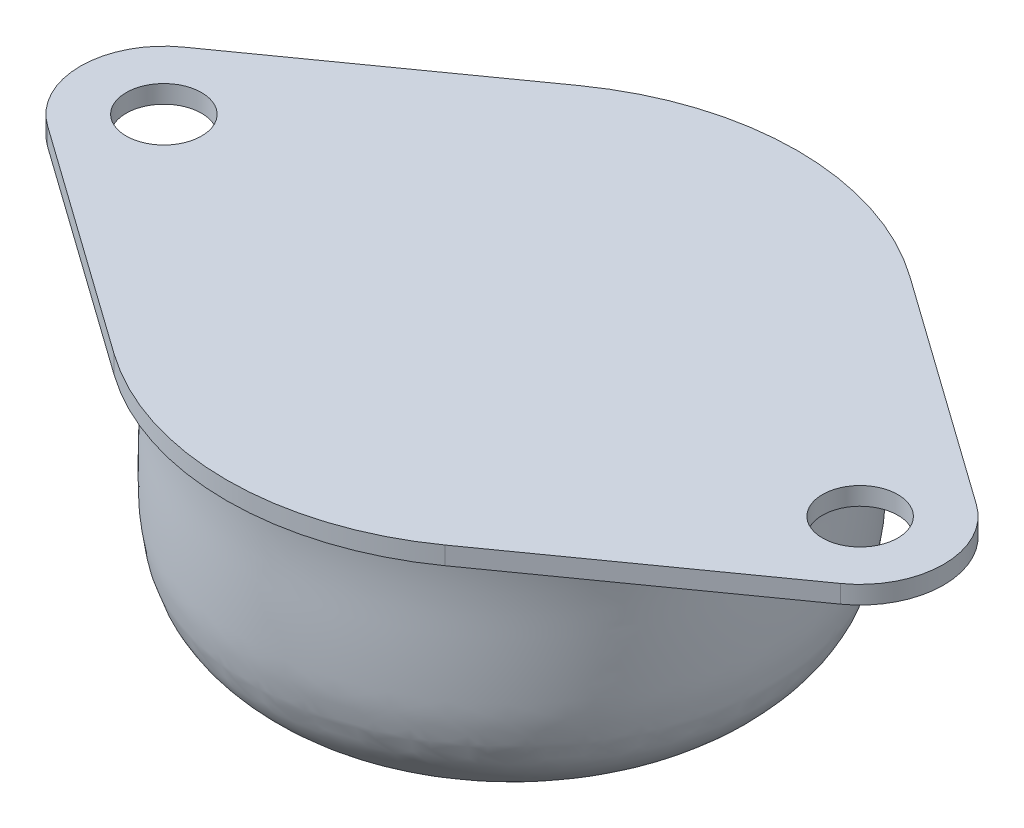
ISO-10303-21;
HEADER;
FILE_DESCRIPTION(('STEP AP214'),'2;1');
FILE_NAME('part.step','',(''),(''),'','','');
FILE_SCHEMA(('AUTOMOTIVE_DESIGN { 1 0 10303 214 1 1 1 1 }'));
ENDSEC;
DATA;
#1=APPLICATION_CONTEXT('core data for automotive mechanical design processes');
#2=APPLICATION_PROTOCOL_DEFINITION('international standard','automotive_design',2000,#1);
#3=PRODUCT_CONTEXT('',#1,'mechanical');
#4=PRODUCT('Part','Part','',(#3));
#5=PRODUCT_RELATED_PRODUCT_CATEGORY('part','',(#4));
#6=PRODUCT_DEFINITION_FORMATION('','',#4);
#7=PRODUCT_DEFINITION_CONTEXT('part definition',#1,'design');
#8=PRODUCT_DEFINITION('design','',#6,#7);
#9=PRODUCT_DEFINITION_SHAPE('','',#8);
#10=(LENGTH_UNIT() NAMED_UNIT(*) SI_UNIT(.MILLI.,.METRE.));
#11=(NAMED_UNIT(*) PLANE_ANGLE_UNIT() SI_UNIT($,.RADIAN.));
#12=(NAMED_UNIT(*) SI_UNIT($,.STERADIAN.) SOLID_ANGLE_UNIT());
#13=UNCERTAINTY_MEASURE_WITH_UNIT(LENGTH_MEASURE(1.E-05),#10,'distance_accuracy_value','');
#14=(GEOMETRIC_REPRESENTATION_CONTEXT(3) GLOBAL_UNCERTAINTY_ASSIGNED_CONTEXT((#13)) GLOBAL_UNIT_ASSIGNED_CONTEXT((#10,
#11,#12)) REPRESENTATION_CONTEXT('',''));
#15=CARTESIAN_POINT('',(0.,0.,0.));
#16=DIRECTION('',(0.,0.,1.));
#17=DIRECTION('',(1.,0.,0.));
#18=AXIS2_PLACEMENT_3D('',#15,#16,#17);
#19=CARTESIAN_POINT('',(0.,-3.29809436405037,0.));
#20=CARTESIAN_POINT('',(0.706455528044404,-3.33261629909782,0.));
#21=CARTESIAN_POINT('',(1.6910722755898,-3.21906486328135,0.));
#22=CARTESIAN_POINT('',(2.77317552219957,-2.87002827500623,0.));
#23=CARTESIAN_POINT('',(3.30502093185583,-2.66529212493262,0.));
#24=CARTESIAN_POINT('',(3.68241570619062,-2.51703889516262,0.));
#25=CARTESIAN_POINT('',(4.05064134544616,-2.35518976592076,0.));
#26=CARTESIAN_POINT('',(4.41669539876457,-2.20481684004063,0.));
#27=CARTESIAN_POINT('',(4.77817461951898,-2.00370671702629,0.));
#28=CARTESIAN_POINT('',(5.09992642423774,-1.75454297339482,0.));
#29=CARTESIAN_POINT('',(5.46924436614032,-1.550129904268,0.));
#30=CARTESIAN_POINT('',(5.86176845220872,-1.24506540903689,0.));
#31=CARTESIAN_POINT('',(6.26501645630921,-0.923290364909008,0.));
#32=CARTESIAN_POINT('',(6.63097437198885,-0.544071896653044,0.));
#33=CARTESIAN_POINT('',(6.92487506853863,-0.139959882478522,0.));
#34=CARTESIAN_POINT('',(7.37060468714255,0.0486860328995412,0.));
#35=CARTESIAN_POINT('',(7.77221826103112,0.161143877248647,0.));
#36=CARTESIAN_POINT('',(8.15898187630584,0.24790246973823,0.));
#37=CARTESIAN_POINT('',(8.57839920401572,0.358534367007594,0.));
#38=CARTESIAN_POINT('',(9.10951981998511,0.547037122191886,0.));
#39=CARTESIAN_POINT('',(9.69818302000994,0.720664570225371,0.));
#40=CARTESIAN_POINT('',(10.2597730853227,0.911045920080707,0.));
#41=CARTESIAN_POINT('',(10.7476107322952,1.02809482491382,0.));
#42=CARTESIAN_POINT('',(11.160281010587,1.21481497705429,0.));
#43=CARTESIAN_POINT('',(11.564815315527,1.48117860850391,0.));
#44=CARTESIAN_POINT('',(12.0001975589636,1.68041647211413,0.));
#45=CARTESIAN_POINT('',(12.456348877655,1.97889324984426,0.));
#46=CARTESIAN_POINT('',(12.8876719363935,2.33976498809418,0.));
#47=CARTESIAN_POINT('',(13.2914143685748,2.77038019782841,0.));
#48=CARTESIAN_POINT('',(13.6220583478846,3.17156146845381,0.));
#49=CARTESIAN_POINT('',(13.8754539399839,3.57421203179499,0.));
#50=CARTESIAN_POINT('',(14.1046298883454,3.98311962165361,0.));
#51=CARTESIAN_POINT('',(14.2480775200247,4.50808303010716,0.));
#52=CARTESIAN_POINT('',(14.4532558029486,4.97798444061005,0.));
#53=CARTESIAN_POINT('',(14.5532895102367,5.61354736358693,0.));
#54=CARTESIAN_POINT('',(14.6887977523506,6.35289882065059,0.));
#55=CARTESIAN_POINT('',(14.7445809334968,7.8503471982155,0.));
#56=CARTESIAN_POINT('',(14.7396624014368,9.91738679198446,0.));
#57=CARTESIAN_POINT('',(14.610748364971,12.7254174718238,0.));
#58=CARTESIAN_POINT('',(14.7455779461825,14.6550653663396,0.));
#59=CARTESIAN_POINT('',(14.9445851739056,15.7019056359496,0.));
#60=B_SPLINE_CURVE_WITH_KNOTS('',3,(#19,#20,#21,#22,#23,#24,#25,#26,#27,#28,#29,#30,#31,#32,#33,
#34,#35,#36,#37,#38,#39,#40,#41,#42,#43,#44,#45,#46,#47,#48,#49,#50,#51,#52,#53,#54,#55,#56,#57,
#58,#59),.UNSPECIFIED.,.F.,.F.,(4,1,1,1,1,1,1,1,1,1,1,1,1,1,1,1,1,1,1,1,1,1,1,1,1,1,1,1,1,1,1,1,
1,1,1,1,1,1,4),(0.,0.0749803268782476,0.104145363424742,0.120682551311053,0.135565386156596,
0.147239075819442,0.163438876454224,0.177614949493722,0.191043321568255,0.206610736255912,
0.222342480892859,0.2438225244745,0.261329251459024,0.278460385116613,0.295787666789211,
0.311179452900584,0.323053347641278,0.337863831243154,0.357273021709261,0.382918323063156,
0.40309839761296,0.420289185049471,0.436132055746469,0.450933536676359,0.471701704495396,
0.486863699890057,0.508750882665339,0.531302671258419,0.549552013705359,0.56388485327492,
0.581874699278751,0.599060538378736,0.621525795582886,0.636019374985955,0.667207467507946,
0.7014132534452,0.794955071123881,0.887064010438371,1.),.UNSPECIFIED.);
#61=CARTESIAN_POINT('',(0.,-3.29809436405037,0.));
#62=DIRECTION('',(0.,-1.,0.));
#63=AXIS1_PLACEMENT('',#61,#62);
#64=SURFACE_OF_REVOLUTION('',#60,#63);
#65=CARTESIAN_POINT('',(0.,-3.29809436405037,0.));
#66=VERTEX_POINT('',#65);
#67=VERTEX_LOOP('',#66);
#68=FACE_BOUND('',#67,.T.);
#69=CARTESIAN_POINT('',(0.,14.7019056359496,0.));
#70=DIRECTION('',(0.,-1.,0.));
#71=DIRECTION('',(0.,0.,-1.));
#72=AXIS2_PLACEMENT_3D('',#69,#70,#71);
#73=CIRCLE('',#72,14.7911016447568);
#74=CARTESIAN_POINT('',(0.,14.7019056359496,-14.7911016447568));
#75=VERTEX_POINT('',#74);
#76=EDGE_CURVE('E11',#75,#75,#73,.T.);
#77=ORIENTED_EDGE('',*,*,#76,.T.);
#78=EDGE_LOOP('',(#77));
#79=FACE_BOUND('',#78,.T.);
#80=ADVANCED_FACE('F41',(#68,#79),#64,.F.);
#81=CARTESIAN_POINT('',(0.,14.7019056359496,0.));
#82=DIRECTION('',(0.,1.,0.));
#83=DIRECTION('',(0.,0.,1.));
#84=AXIS2_PLACEMENT_3D('',#81,#82,#83);
#85=CYLINDRICAL_SURFACE('',#84,15.9);
#86=CARTESIAN_POINT('',(0.,15.7019056359496,0.));
#87=DIRECTION('',(0.,1.,0.));
#88=DIRECTION('',(0.,0.,1.));
#89=AXIS2_PLACEMENT_3D('',#86,#87,#88);
#90=CIRCLE('',#89,15.9);
#91=CARTESIAN_POINT('',(9.22036082474227,15.7019056359496,-12.9535688619607));
#92=VERTEX_POINT('',#91);
#93=CARTESIAN_POINT('',(-9.22036082474227,15.7019056359496,-12.9535688619607));
#94=VERTEX_POINT('',#93);
#95=EDGE_CURVE('E149',#92,#94,#90,.T.);
#96=ORIENTED_EDGE('',*,*,#95,.F.);
#97=DIRECTION('',(0.,1.,0.));
#98=VECTOR('',#97,1.);
#99=CARTESIAN_POINT('',(9.22036082474227,14.7019056359496,-12.9535688619607));
#100=LINE('',#99,#98);
#101=CARTESIAN_POINT('',(9.22036082474227,14.7019056359496,-12.9535688619607));
#102=VERTEX_POINT('',#101);
#103=EDGE_CURVE('E49',#102,#92,#100,.T.);
#104=ORIENTED_EDGE('',*,*,#103,.F.);
#105=CARTESIAN_POINT('',(0.,14.7019056359496,0.));
#106=DIRECTION('',(0.,1.,0.));
#107=DIRECTION('',(0.,0.,1.));
#108=AXIS2_PLACEMENT_3D('',#105,#106,#107);
#109=CIRCLE('',#108,15.9);
#110=CARTESIAN_POINT('',(-9.22036082474227,14.7019056359496,-12.9535688619607));
#111=VERTEX_POINT('',#110);
#112=EDGE_CURVE('E179',#102,#111,#109,.T.);
#113=ORIENTED_EDGE('',*,*,#112,.T.);
#114=DIRECTION('',(0.,1.,0.));
#115=VECTOR('',#114,1.);
#116=CARTESIAN_POINT('',(-9.22036082474227,14.7019056359496,-12.9535688619607));
#117=LINE('',#116,#115);
#118=EDGE_CURVE('E97',#111,#94,#117,.T.);
#119=ORIENTED_EDGE('',*,*,#118,.T.);
#120=EDGE_LOOP('',(#96,#104,#113,#119));
#121=FACE_BOUND('',#120,.T.);
#122=ADVANCED_FACE('F202',(#121),#85,.T.);
#123=CARTESIAN_POINT('',(9.22036082474227,14.7019056359496,-12.9535688619607));
#124=DIRECTION('',(0.579896907216495,0.,-0.81468986553212));
#125=DIRECTION('',(-0.81468986553212,0.,-0.579896907216495));
#126=AXIS2_PLACEMENT_3D('',#123,#124,#125);
#127=PLANE('',#126);
#128=DIRECTION('',(-0.81468986553212,0.,-0.579896907216495));
#129=VECTOR('',#128,1.);
#130=CARTESIAN_POINT('',(9.22036082474227,15.7019056359496,-12.9535688619607));
#131=LINE('',#130,#129);
#132=CARTESIAN_POINT('',(22.0965206185567,15.7019056359496,-3.78830787472436));
#133=VERTEX_POINT('',#132);
#134=EDGE_CURVE('E175',#133,#92,#131,.T.);
#135=ORIENTED_EDGE('',*,*,#134,.F.);
#136=DIRECTION('',(0.,1.,0.));
#137=VECTOR('',#136,1.);
#138=CARTESIAN_POINT('',(22.0965206185567,14.7019056359496,-3.78830787472436));
#139=LINE('',#138,#137);
#140=CARTESIAN_POINT('',(22.0965206185567,14.7019056359496,-3.78830787472436));
#141=VERTEX_POINT('',#140);
#142=EDGE_CURVE('E126',#141,#133,#139,.T.);
#143=ORIENTED_EDGE('',*,*,#142,.F.);
#144=DIRECTION('',(-0.81468986553212,0.,-0.579896907216495));
#145=VECTOR('',#144,1.);
#146=CARTESIAN_POINT('',(9.22036082474227,14.7019056359496,-12.9535688619607));
#147=LINE('',#146,#145);
#148=EDGE_CURVE('E135',#141,#102,#147,.T.);
#149=ORIENTED_EDGE('',*,*,#148,.T.);
#150=ORIENTED_EDGE('',*,*,#103,.T.);
#151=EDGE_LOOP('',(#135,#143,#149,#150));
#152=FACE_BOUND('',#151,.T.);
#153=ADVANCED_FACE('F207',(#152),#127,.T.);
#154=CARTESIAN_POINT('',(19.4,14.7019056359496,0.));
#155=DIRECTION('',(0.,1.,0.));
#156=DIRECTION('',(0.,0.,1.));
#157=AXIS2_PLACEMENT_3D('',#154,#155,#156);
#158=CYLINDRICAL_SURFACE('',#157,4.65);
#159=CARTESIAN_POINT('',(19.4,15.7019056359496,0.));
#160=DIRECTION('',(0.,1.,0.));
#161=DIRECTION('',(0.,0.,1.));
#162=AXIS2_PLACEMENT_3D('',#159,#160,#161);
#163=CIRCLE('',#162,4.65);
#164=CARTESIAN_POINT('',(22.0965206185567,15.7019056359496,3.78830787472436));
#165=VERTEX_POINT('',#164);
#166=EDGE_CURVE('E120',#165,#133,#163,.T.);
#167=ORIENTED_EDGE('',*,*,#166,.F.);
#168=DIRECTION('',(0.,1.,0.));
#169=VECTOR('',#168,1.);
#170=CARTESIAN_POINT('',(22.0965206185567,14.7019056359496,3.78830787472436));
#171=LINE('',#170,#169);
#172=CARTESIAN_POINT('',(22.0965206185567,14.7019056359496,3.78830787472436));
#173=VERTEX_POINT('',#172);
#174=EDGE_CURVE('E114',#173,#165,#171,.T.);
#175=ORIENTED_EDGE('',*,*,#174,.F.);
#176=CARTESIAN_POINT('',(19.4,14.7019056359496,0.));
#177=DIRECTION('',(0.,1.,0.));
#178=DIRECTION('',(0.,0.,1.));
#179=AXIS2_PLACEMENT_3D('',#176,#177,#178);
#180=CIRCLE('',#179,4.65);
#181=EDGE_CURVE('E117',#173,#141,#180,.T.);
#182=ORIENTED_EDGE('',*,*,#181,.T.);
#183=ORIENTED_EDGE('',*,*,#142,.T.);
#184=EDGE_LOOP('',(#167,#175,#182,#183));
#185=FACE_BOUND('',#184,.T.);
#186=ADVANCED_FACE('F116',(#185),#158,.T.);
#187=CARTESIAN_POINT('',(22.0965206185567,14.7019056359496,3.78830787472436));
#188=DIRECTION('',(0.579896907216495,0.,0.81468986553212));
#189=DIRECTION('',(0.81468986553212,0.,-0.579896907216495));
#190=AXIS2_PLACEMENT_3D('',#187,#188,#189);
#191=PLANE('',#190);
#192=DIRECTION('',(0.81468986553212,0.,-0.579896907216495));
#193=VECTOR('',#192,1.);
#194=CARTESIAN_POINT('',(22.0965206185567,15.7019056359496,3.78830787472436));
#195=LINE('',#194,#193);
#196=CARTESIAN_POINT('',(9.22036082474227,15.7019056359496,12.9535688619607));
#197=VERTEX_POINT('',#196);
#198=EDGE_CURVE('E170',#197,#165,#195,.T.);
#199=ORIENTED_EDGE('',*,*,#198,.F.);
#200=DIRECTION('',(0.,1.,0.));
#201=VECTOR('',#200,1.);
#202=CARTESIAN_POINT('',(9.22036082474227,14.7019056359496,12.9535688619607));
#203=LINE('',#202,#201);
#204=CARTESIAN_POINT('',(9.22036082474227,14.7019056359496,12.9535688619607));
#205=VERTEX_POINT('',#204);
#206=EDGE_CURVE('E127',#205,#197,#203,.T.);
#207=ORIENTED_EDGE('',*,*,#206,.F.);
#208=DIRECTION('',(0.81468986553212,0.,-0.579896907216495));
#209=VECTOR('',#208,1.);
#210=CARTESIAN_POINT('',(22.0965206185567,14.7019056359496,3.78830787472436));
#211=LINE('',#210,#209);
#212=EDGE_CURVE('E133',#205,#173,#211,.T.);
#213=ORIENTED_EDGE('',*,*,#212,.T.);
#214=ORIENTED_EDGE('',*,*,#174,.T.);
#215=EDGE_LOOP('',(#199,#207,#213,#214));
#216=FACE_BOUND('',#215,.T.);
#217=ADVANCED_FACE('F138',(#216),#191,.T.);
#218=CARTESIAN_POINT('',(0.,14.7019056359496,0.));
#219=DIRECTION('',(0.,1.,0.));
#220=DIRECTION('',(0.,0.,1.));
#221=AXIS2_PLACEMENT_3D('',#218,#219,#220);
#222=CYLINDRICAL_SURFACE('',#221,15.9);
#223=CARTESIAN_POINT('',(0.,15.7019056359496,0.));
#224=DIRECTION('',(0.,1.,0.));
#225=DIRECTION('',(0.,0.,1.));
#226=AXIS2_PLACEMENT_3D('',#223,#224,#225);
#227=CIRCLE('',#226,15.9);
#228=CARTESIAN_POINT('',(-9.22036082474227,15.7019056359496,12.9535688619607));
#229=VERTEX_POINT('',#228);
#230=EDGE_CURVE('E166',#229,#197,#227,.T.);
#231=ORIENTED_EDGE('',*,*,#230,.F.);
#232=DIRECTION('',(0.,1.,0.));
#233=VECTOR('',#232,1.);
#234=CARTESIAN_POINT('',(-9.22036082474227,14.7019056359496,12.9535688619607));
#235=LINE('',#234,#233);
#236=CARTESIAN_POINT('',(-9.22036082474227,14.7019056359496,12.9535688619607));
#237=VERTEX_POINT('',#236);
#238=EDGE_CURVE('E186',#237,#229,#235,.T.);
#239=ORIENTED_EDGE('',*,*,#238,.F.);
#240=CARTESIAN_POINT('',(0.,14.7019056359496,0.));
#241=DIRECTION('',(0.,1.,0.));
#242=DIRECTION('',(0.,0.,1.));
#243=AXIS2_PLACEMENT_3D('',#240,#241,#242);
#244=CIRCLE('',#243,15.9);
#245=EDGE_CURVE('E140',#237,#205,#244,.T.);
#246=ORIENTED_EDGE('',*,*,#245,.T.);
#247=ORIENTED_EDGE('',*,*,#206,.T.);
#248=EDGE_LOOP('',(#231,#239,#246,#247));
#249=FACE_BOUND('',#248,.T.);
#250=ADVANCED_FACE('F262',(#249),#222,.T.);
#251=CARTESIAN_POINT('',(-22.0965206185567,14.7019056359496,3.78830787472436));
#252=DIRECTION('',(-0.579896907216495,0.,0.81468986553212));
#253=DIRECTION('',(0.81468986553212,0.,0.579896907216495));
#254=AXIS2_PLACEMENT_3D('',#251,#252,#253);
#255=PLANE('',#254);
#256=DIRECTION('',(0.81468986553212,0.,0.579896907216495));
#257=VECTOR('',#256,1.);
#258=CARTESIAN_POINT('',(-22.0965206185567,15.7019056359496,3.78830787472436));
#259=LINE('',#258,#257);
#260=CARTESIAN_POINT('',(-22.0965206185567,15.7019056359496,3.78830787472436));
#261=VERTEX_POINT('',#260);
#262=EDGE_CURVE('E162',#261,#229,#259,.T.);
#263=ORIENTED_EDGE('',*,*,#262,.F.);
#264=DIRECTION('',(0.,1.,0.));
#265=VECTOR('',#264,1.);
#266=CARTESIAN_POINT('',(-22.0965206185567,14.7019056359496,3.78830787472436));
#267=LINE('',#266,#265);
#268=CARTESIAN_POINT('',(-22.0965206185567,14.7019056359496,3.78830787472436));
#269=VERTEX_POINT('',#268);
#270=EDGE_CURVE('E189',#269,#261,#267,.T.);
#271=ORIENTED_EDGE('',*,*,#270,.F.);
#272=DIRECTION('',(0.81468986553212,0.,0.579896907216495));
#273=VECTOR('',#272,1.);
#274=CARTESIAN_POINT('',(-22.0965206185567,14.7019056359496,3.78830787472436));
#275=LINE('',#274,#273);
#276=EDGE_CURVE('E143',#269,#237,#275,.T.);
#277=ORIENTED_EDGE('',*,*,#276,.T.);
#278=ORIENTED_EDGE('',*,*,#238,.T.);
#279=EDGE_LOOP('',(#263,#271,#277,#278));
#280=FACE_BOUND('',#279,.T.);
#281=ADVANCED_FACE('F256',(#280),#255,.T.);
#282=CARTESIAN_POINT('',(-19.4,14.7019056359496,0.));
#283=DIRECTION('',(0.,1.,0.));
#284=DIRECTION('',(0.,0.,1.));
#285=AXIS2_PLACEMENT_3D('',#282,#283,#284);
#286=CYLINDRICAL_SURFACE('',#285,4.65);
#287=CARTESIAN_POINT('',(-19.4,15.7019056359496,0.));
#288=DIRECTION('',(0.,1.,0.));
#289=DIRECTION('',(0.,0.,-1.));
#290=AXIS2_PLACEMENT_3D('',#287,#288,#289);
#291=CIRCLE('',#290,4.65);
#292=CARTESIAN_POINT('',(-22.0965206185567,15.7019056359496,-3.78830787472436));
#293=VERTEX_POINT('',#292);
#294=EDGE_CURVE('E158',#293,#261,#291,.T.);
#295=ORIENTED_EDGE('',*,*,#294,.F.);
#296=DIRECTION('',(0.,1.,0.));
#297=VECTOR('',#296,1.);
#298=CARTESIAN_POINT('',(-22.0965206185567,14.7019056359496,-3.78830787472436));
#299=LINE('',#298,#297);
#300=CARTESIAN_POINT('',(-22.0965206185567,14.7019056359496,-3.78830787472436));
#301=VERTEX_POINT('',#300);
#302=EDGE_CURVE('E192',#301,#293,#299,.T.);
#303=ORIENTED_EDGE('',*,*,#302,.F.);
#304=CARTESIAN_POINT('',(-19.4,14.7019056359496,0.));
#305=DIRECTION('',(0.,1.,0.));
#306=DIRECTION('',(0.,0.,-1.));
#307=AXIS2_PLACEMENT_3D('',#304,#305,#306);
#308=CIRCLE('',#307,4.65);
#309=EDGE_CURVE('E248',#301,#269,#308,.T.);
#310=ORIENTED_EDGE('',*,*,#309,.T.);
#311=ORIENTED_EDGE('',*,*,#270,.T.);
#312=EDGE_LOOP('',(#295,#303,#310,#311));
#313=FACE_BOUND('',#312,.T.);
#314=ADVANCED_FACE('F260',(#313),#286,.T.);
#315=CARTESIAN_POINT('',(-9.22036082474227,14.7019056359496,-12.9535688619607));
#316=DIRECTION('',(-0.579896907216495,0.,-0.81468986553212));
#317=DIRECTION('',(-0.81468986553212,0.,0.579896907216495));
#318=AXIS2_PLACEMENT_3D('',#315,#316,#317);
#319=PLANE('',#318);
#320=DIRECTION('',(-0.81468986553212,0.,0.579896907216495));
#321=VECTOR('',#320,1.);
#322=CARTESIAN_POINT('',(-9.22036082474227,15.7019056359496,-12.9535688619607));
#323=LINE('',#322,#321);
#324=EDGE_CURVE('E153',#94,#293,#323,.T.);
#325=ORIENTED_EDGE('',*,*,#324,.F.);
#326=ORIENTED_EDGE('',*,*,#118,.F.);
#327=DIRECTION('',(-0.81468986553212,0.,0.579896907216495));
#328=VECTOR('',#327,1.);
#329=CARTESIAN_POINT('',(-9.22036082474227,14.7019056359496,-12.9535688619607));
#330=LINE('',#329,#328);
#331=EDGE_CURVE('E245',#111,#301,#330,.T.);
#332=ORIENTED_EDGE('',*,*,#331,.T.);
#333=ORIENTED_EDGE('',*,*,#302,.T.);
#334=EDGE_LOOP('',(#325,#326,#332,#333));
#335=FACE_BOUND('',#334,.T.);
#336=ADVANCED_FACE('F203',(#335),#319,.T.);
#337=CARTESIAN_POINT('',(0.,14.7019056359496,0.));
#338=DIRECTION('',(0.,1.,0.));
#339=DIRECTION('',(0.,0.,1.));
#340=AXIS2_PLACEMENT_3D('',#337,#338,#339);
#341=PLANE('',#340);
#342=ORIENTED_EDGE('',*,*,#76,.F.);
#343=EDGE_LOOP('',(#342));
#344=FACE_BOUND('',#343,.T.);
#345=CARTESIAN_POINT('',(-19.4,14.7019056359496,0.));
#346=DIRECTION('',(0.,1.,0.));
#347=DIRECTION('',(0.,0.,-1.));
#348=AXIS2_PLACEMENT_3D('',#345,#346,#347);
#349=CIRCLE('',#348,2.1);
#350=CARTESIAN_POINT('',(-19.4,14.7019056359496,-2.1));
#351=VERTEX_POINT('',#350);
#352=EDGE_CURVE('E229',#351,#351,#349,.T.);
#353=ORIENTED_EDGE('',*,*,#352,.T.);
#354=EDGE_LOOP('',(#353));
#355=FACE_BOUND('',#354,.T.);
#356=CARTESIAN_POINT('',(19.4,14.7019056359496,0.));
#357=DIRECTION('',(0.,1.,0.));
#358=DIRECTION('',(0.,0.,1.));
#359=AXIS2_PLACEMENT_3D('',#356,#357,#358);
#360=CIRCLE('',#359,2.1);
#361=CARTESIAN_POINT('',(19.4,14.7019056359496,2.1));
#362=VERTEX_POINT('',#361);
#363=EDGE_CURVE('E154',#362,#362,#360,.T.);
#364=ORIENTED_EDGE('',*,*,#363,.T.);
#365=EDGE_LOOP('',(#364));
#366=FACE_BOUND('',#365,.T.);
#367=ORIENTED_EDGE('',*,*,#112,.F.);
#368=ORIENTED_EDGE('',*,*,#148,.F.);
#369=ORIENTED_EDGE('',*,*,#181,.F.);
#370=ORIENTED_EDGE('',*,*,#212,.F.);
#371=ORIENTED_EDGE('',*,*,#245,.F.);
#372=ORIENTED_EDGE('',*,*,#276,.F.);
#373=ORIENTED_EDGE('',*,*,#309,.F.);
#374=ORIENTED_EDGE('',*,*,#331,.F.);
#375=EDGE_LOOP('',(#367,#368,#369,#370,#371,#372,#373,#374));
#376=FACE_BOUND('',#375,.T.);
#377=ADVANCED_FACE('F131',(#344,#355,#366,#376),#341,.F.);
#378=CARTESIAN_POINT('',(19.4,14.7019056359496,0.));
#379=DIRECTION('',(0.,1.,0.));
#380=DIRECTION('',(0.,0.,1.));
#381=AXIS2_PLACEMENT_3D('',#378,#379,#380);
#382=CYLINDRICAL_SURFACE('',#381,2.1);
#383=ORIENTED_EDGE('',*,*,#363,.F.);
#384=EDGE_LOOP('',(#383));
#385=FACE_BOUND('',#384,.T.);
#386=CARTESIAN_POINT('',(19.4,15.7019056359496,0.));
#387=DIRECTION('',(0.,1.,0.));
#388=DIRECTION('',(0.,0.,1.));
#389=AXIS2_PLACEMENT_3D('',#386,#387,#388);
#390=CIRCLE('',#389,2.1);
#391=CARTESIAN_POINT('',(19.4,15.7019056359496,2.1));
#392=VERTEX_POINT('',#391);
#393=EDGE_CURVE('E234',#392,#392,#390,.T.);
#394=ORIENTED_EDGE('',*,*,#393,.T.);
#395=EDGE_LOOP('',(#394));
#396=FACE_BOUND('',#395,.T.);
#397=ADVANCED_FACE('F225',(#385,#396),#382,.F.);
#398=CARTESIAN_POINT('',(-19.4,14.7019056359496,0.));
#399=DIRECTION('',(0.,1.,0.));
#400=DIRECTION('',(0.,0.,1.));
#401=AXIS2_PLACEMENT_3D('',#398,#399,#400);
#402=CYLINDRICAL_SURFACE('',#401,2.1);
#403=ORIENTED_EDGE('',*,*,#352,.F.);
#404=EDGE_LOOP('',(#403));
#405=FACE_BOUND('',#404,.T.);
#406=CARTESIAN_POINT('',(-19.4,15.7019056359496,0.));
#407=DIRECTION('',(0.,1.,0.));
#408=DIRECTION('',(0.,0.,-1.));
#409=AXIS2_PLACEMENT_3D('',#406,#407,#408);
#410=CIRCLE('',#409,2.1);
#411=CARTESIAN_POINT('',(-19.4,15.7019056359496,-2.1));
#412=VERTEX_POINT('',#411);
#413=EDGE_CURVE('E240',#412,#412,#410,.T.);
#414=ORIENTED_EDGE('',*,*,#413,.T.);
#415=EDGE_LOOP('',(#414));
#416=FACE_BOUND('',#415,.T.);
#417=ADVANCED_FACE('F276',(#405,#416),#402,.F.);
#418=CARTESIAN_POINT('',(14.9445851739056,15.7019056359496,0.));
#419=DIRECTION('',(0.,1.,0.));
#420=DIRECTION('',(0.,0.,1.));
#421=AXIS2_PLACEMENT_3D('',#418,#419,#420);
#422=PLANE('',#421);
#423=ORIENTED_EDGE('',*,*,#413,.F.);
#424=EDGE_LOOP('',(#423));
#425=FACE_BOUND('',#424,.T.);
#426=ORIENTED_EDGE('',*,*,#393,.F.);
#427=EDGE_LOOP('',(#426));
#428=FACE_BOUND('',#427,.T.);
#429=ORIENTED_EDGE('',*,*,#95,.T.);
#430=ORIENTED_EDGE('',*,*,#324,.T.);
#431=ORIENTED_EDGE('',*,*,#294,.T.);
#432=ORIENTED_EDGE('',*,*,#262,.T.);
#433=ORIENTED_EDGE('',*,*,#230,.T.);
#434=ORIENTED_EDGE('',*,*,#198,.T.);
#435=ORIENTED_EDGE('',*,*,#166,.T.);
#436=ORIENTED_EDGE('',*,*,#134,.T.);
#437=EDGE_LOOP('',(#429,#430,#431,#432,#433,#434,#435,#436));
#438=FACE_BOUND('',#437,.T.);
#439=ADVANCED_FACE('F206',(#425,#428,#438),#422,.T.);
#440=CLOSED_SHELL('',(#80,#122,#153,#186,#217,#250,#281,#314,#336,#377,#397,#417,#439));
#441=MANIFOLD_SOLID_BREP('B2',#440);
#442=ADVANCED_BREP_SHAPE_REPRESENTATION('',(#18,#441),#14);
#443=SHAPE_DEFINITION_REPRESENTATION(#9,#442);
ENDSEC;
END-ISO-10303-21;
